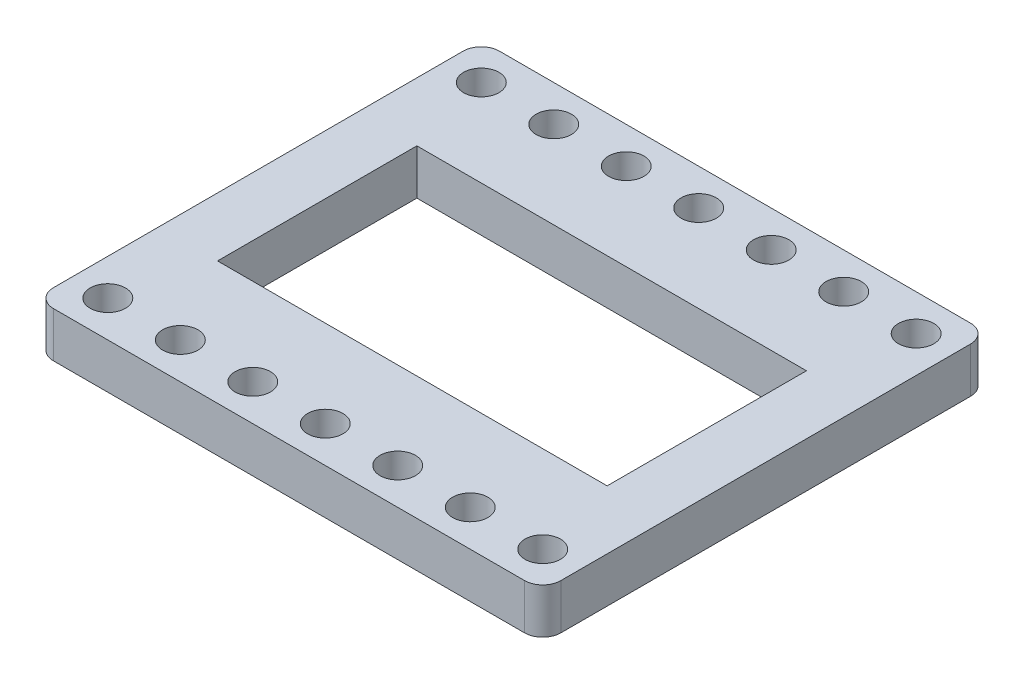
ISO-10303-21;
HEADER;
FILE_DESCRIPTION(('STEP AP214'),'2;1');
FILE_NAME('part.step','',(''),(''),'','','');
FILE_SCHEMA(('AUTOMOTIVE_DESIGN { 1 0 10303 214 1 1 1 1 }'));
ENDSEC;
DATA;
#1=APPLICATION_CONTEXT('core data for automotive mechanical design processes');
#2=APPLICATION_PROTOCOL_DEFINITION('international standard','automotive_design',2000,#1);
#3=PRODUCT_CONTEXT('',#1,'mechanical');
#4=PRODUCT('Part','Part','',(#3));
#5=PRODUCT_RELATED_PRODUCT_CATEGORY('part','',(#4));
#6=PRODUCT_DEFINITION_FORMATION('','',#4);
#7=PRODUCT_DEFINITION_CONTEXT('part definition',#1,'design');
#8=PRODUCT_DEFINITION('design','',#6,#7);
#9=PRODUCT_DEFINITION_SHAPE('','',#8);
#10=(LENGTH_UNIT() NAMED_UNIT(*) SI_UNIT(.MILLI.,.METRE.));
#11=(NAMED_UNIT(*) PLANE_ANGLE_UNIT() SI_UNIT($,.RADIAN.));
#12=(NAMED_UNIT(*) SI_UNIT($,.STERADIAN.) SOLID_ANGLE_UNIT());
#13=UNCERTAINTY_MEASURE_WITH_UNIT(LENGTH_MEASURE(1.E-05),#10,'distance_accuracy_value','');
#14=(GEOMETRIC_REPRESENTATION_CONTEXT(3) GLOBAL_UNCERTAINTY_ASSIGNED_CONTEXT((#13)) GLOBAL_UNIT_ASSIGNED_CONTEXT((#10,
#11,#12)) REPRESENTATION_CONTEXT('',''));
#15=CARTESIAN_POINT('',(0.,0.,0.));
#16=DIRECTION('',(0.,0.,1.));
#17=DIRECTION('',(1.,0.,0.));
#18=AXIS2_PLACEMENT_3D('',#15,#16,#17);
#19=CARTESIAN_POINT('',(-1.99999999999999,5.,47.22));
#20=DIRECTION('',(0.,-1.,0.));
#21=DIRECTION('',(0.,0.,-1.));
#22=AXIS2_PLACEMENT_3D('',#19,#20,#21);
#23=CYLINDRICAL_SURFACE('',#22,2.);
#24=CARTESIAN_POINT('',(-1.99999999999999,0.,47.22));
#25=DIRECTION('',(0.,1.,0.));
#26=DIRECTION('',(0.,0.,1.));
#27=AXIS2_PLACEMENT_3D('',#24,#25,#26);
#28=CIRCLE('',#27,2.);
#29=CARTESIAN_POINT('',(-1.99999999999999,0.,49.22));
#30=VERTEX_POINT('',#29);
#31=CARTESIAN_POINT('',(0.,0.,47.22));
#32=VERTEX_POINT('',#31);
#33=EDGE_CURVE('E241',#30,#32,#28,.T.);
#34=ORIENTED_EDGE('',*,*,#33,.T.);
#35=DIRECTION('',(0.,-1.,0.));
#36=VECTOR('',#35,1.);
#37=CARTESIAN_POINT('',(0.,5.,47.22));
#38=LINE('',#37,#36);
#39=CARTESIAN_POINT('',(0.,5.,47.22));
#40=VERTEX_POINT('',#39);
#41=EDGE_CURVE('E12',#40,#32,#38,.T.);
#42=ORIENTED_EDGE('',*,*,#41,.F.);
#43=CARTESIAN_POINT('',(-1.99999999999999,5.,47.22));
#44=DIRECTION('',(0.,1.,0.));
#45=DIRECTION('',(0.,0.,1.));
#46=AXIS2_PLACEMENT_3D('',#43,#44,#45);
#47=CIRCLE('',#46,2.);
#48=CARTESIAN_POINT('',(-1.99999999999999,5.,49.22));
#49=VERTEX_POINT('',#48);
#50=EDGE_CURVE('E204',#49,#40,#47,.T.);
#51=ORIENTED_EDGE('',*,*,#50,.F.);
#52=DIRECTION('',(0.,-1.,0.));
#53=VECTOR('',#52,1.);
#54=CARTESIAN_POINT('',(-1.99999999999999,5.,49.22));
#55=LINE('',#54,#53);
#56=EDGE_CURVE('E240',#49,#30,#55,.T.);
#57=ORIENTED_EDGE('',*,*,#56,.T.);
#58=EDGE_LOOP('',(#34,#42,#51,#57));
#59=FACE_BOUND('',#58,.T.);
#60=ADVANCED_FACE('F37',(#59),#23,.T.);
#61=CARTESIAN_POINT('',(0.,5.,2.));
#62=DIRECTION('',(-1.,0.,0.));
#63=DIRECTION('',(0.,0.,1.));
#64=AXIS2_PLACEMENT_3D('',#61,#62,#63);
#65=PLANE('',#64);
#66=DIRECTION('',(0.,0.,-1.));
#67=VECTOR('',#66,1.);
#68=CARTESIAN_POINT('',(0.,0.,2.));
#69=LINE('',#68,#67);
#70=CARTESIAN_POINT('',(0.,0.,2.));
#71=VERTEX_POINT('',#70);
#72=EDGE_CURVE('E244',#32,#71,#69,.T.);
#73=ORIENTED_EDGE('',*,*,#72,.T.);
#74=DIRECTION('',(0.,-1.,0.));
#75=VECTOR('',#74,1.);
#76=CARTESIAN_POINT('',(0.,5.,2.));
#77=LINE('',#76,#75);
#78=CARTESIAN_POINT('',(0.,5.,2.));
#79=VERTEX_POINT('',#78);
#80=EDGE_CURVE('E44',#79,#71,#77,.T.);
#81=ORIENTED_EDGE('',*,*,#80,.F.);
#82=DIRECTION('',(0.,0.,-1.));
#83=VECTOR('',#82,1.);
#84=CARTESIAN_POINT('',(0.,5.,2.));
#85=LINE('',#84,#83);
#86=EDGE_CURVE('E209',#40,#79,#85,.T.);
#87=ORIENTED_EDGE('',*,*,#86,.F.);
#88=ORIENTED_EDGE('',*,*,#41,.T.);
#89=EDGE_LOOP('',(#73,#81,#87,#88));
#90=FACE_BOUND('',#89,.T.);
#91=ADVANCED_FACE('F435',(#90),#65,.F.);
#92=CARTESIAN_POINT('',(-2.,5.,2.));
#93=DIRECTION('',(0.,-1.,0.));
#94=DIRECTION('',(0.,0.,-1.));
#95=AXIS2_PLACEMENT_3D('',#92,#93,#94);
#96=CYLINDRICAL_SURFACE('',#95,2.);
#97=CARTESIAN_POINT('',(-2.,0.,2.));
#98=DIRECTION('',(0.,1.,0.));
#99=DIRECTION('',(0.,0.,-1.));
#100=AXIS2_PLACEMENT_3D('',#97,#98,#99);
#101=CIRCLE('',#100,2.);
#102=CARTESIAN_POINT('',(-2.,0.,0.));
#103=VERTEX_POINT('',#102);
#104=EDGE_CURVE('E246',#71,#103,#101,.T.);
#105=ORIENTED_EDGE('',*,*,#104,.T.);
#106=DIRECTION('',(0.,-1.,0.));
#107=VECTOR('',#106,1.);
#108=CARTESIAN_POINT('',(-2.,5.,0.));
#109=LINE('',#108,#107);
#110=CARTESIAN_POINT('',(-2.,5.,0.));
#111=VERTEX_POINT('',#110);
#112=EDGE_CURVE('E271',#111,#103,#109,.T.);
#113=ORIENTED_EDGE('',*,*,#112,.F.);
#114=CARTESIAN_POINT('',(-2.,5.,2.));
#115=DIRECTION('',(0.,1.,0.));
#116=DIRECTION('',(0.,0.,-1.));
#117=AXIS2_PLACEMENT_3D('',#114,#115,#116);
#118=CIRCLE('',#117,2.);
#119=EDGE_CURVE('E214',#79,#111,#118,.T.);
#120=ORIENTED_EDGE('',*,*,#119,.F.);
#121=ORIENTED_EDGE('',*,*,#80,.T.);
#122=EDGE_LOOP('',(#105,#113,#120,#121));
#123=FACE_BOUND('',#122,.T.);
#124=ADVANCED_FACE('F278',(#123),#96,.T.);
#125=CARTESIAN_POINT('',(-54.,5.,0.));
#126=DIRECTION('',(0.,0.,1.));
#127=DIRECTION('',(1.,0.,0.));
#128=AXIS2_PLACEMENT_3D('',#125,#126,#127);
#129=PLANE('',#128);
#130=DIRECTION('',(-1.,0.,0.));
#131=VECTOR('',#130,1.);
#132=CARTESIAN_POINT('',(-54.,0.,0.));
#133=LINE('',#132,#131);
#134=CARTESIAN_POINT('',(-54.,0.,0.));
#135=VERTEX_POINT('',#134);
#136=EDGE_CURVE('E248',#103,#135,#133,.T.);
#137=ORIENTED_EDGE('',*,*,#136,.T.);
#138=DIRECTION('',(0.,-1.,0.));
#139=VECTOR('',#138,1.);
#140=CARTESIAN_POINT('',(-54.,5.,0.));
#141=LINE('',#140,#139);
#142=CARTESIAN_POINT('',(-54.,5.,0.));
#143=VERTEX_POINT('',#142);
#144=EDGE_CURVE('E268',#143,#135,#141,.T.);
#145=ORIENTED_EDGE('',*,*,#144,.F.);
#146=DIRECTION('',(-1.,0.,0.));
#147=VECTOR('',#146,1.);
#148=CARTESIAN_POINT('',(-54.,5.,0.));
#149=LINE('',#148,#147);
#150=EDGE_CURVE('E222',#111,#143,#149,.T.);
#151=ORIENTED_EDGE('',*,*,#150,.F.);
#152=ORIENTED_EDGE('',*,*,#112,.T.);
#153=EDGE_LOOP('',(#137,#145,#151,#152));
#154=FACE_BOUND('',#153,.T.);
#155=ADVANCED_FACE('F288',(#154),#129,.F.);
#156=CARTESIAN_POINT('',(-54.,5.,2.));
#157=DIRECTION('',(0.,-1.,0.));
#158=DIRECTION('',(0.,0.,-1.));
#159=AXIS2_PLACEMENT_3D('',#156,#157,#158);
#160=CYLINDRICAL_SURFACE('',#159,2.);
#161=CARTESIAN_POINT('',(-54.,0.,2.));
#162=DIRECTION('',(0.,1.,0.));
#163=DIRECTION('',(0.,0.,1.));
#164=AXIS2_PLACEMENT_3D('',#161,#162,#163);
#165=CIRCLE('',#164,2.);
#166=CARTESIAN_POINT('',(-56.,0.,2.));
#167=VERTEX_POINT('',#166);
#168=EDGE_CURVE('E250',#135,#167,#165,.T.);
#169=ORIENTED_EDGE('',*,*,#168,.T.);
#170=DIRECTION('',(0.,-1.,0.));
#171=VECTOR('',#170,1.);
#172=CARTESIAN_POINT('',(-56.,5.,2.));
#173=LINE('',#172,#171);
#174=CARTESIAN_POINT('',(-56.,5.,2.));
#175=VERTEX_POINT('',#174);
#176=EDGE_CURVE('E265',#175,#167,#173,.T.);
#177=ORIENTED_EDGE('',*,*,#176,.F.);
#178=CARTESIAN_POINT('',(-54.,5.,2.));
#179=DIRECTION('',(0.,1.,0.));
#180=DIRECTION('',(0.,0.,1.));
#181=AXIS2_PLACEMENT_3D('',#178,#179,#180);
#182=CIRCLE('',#181,2.);
#183=EDGE_CURVE('E225',#143,#175,#182,.T.);
#184=ORIENTED_EDGE('',*,*,#183,.F.);
#185=ORIENTED_EDGE('',*,*,#144,.T.);
#186=EDGE_LOOP('',(#169,#177,#184,#185));
#187=FACE_BOUND('',#186,.T.);
#188=ADVANCED_FACE('F292',(#187),#160,.T.);
#189=CARTESIAN_POINT('',(-56.,5.,2.));
#190=DIRECTION('',(1.,0.,0.));
#191=DIRECTION('',(0.,0.,-1.));
#192=AXIS2_PLACEMENT_3D('',#189,#190,#191);
#193=PLANE('',#192);
#194=DIRECTION('',(0.,0.,1.));
#195=VECTOR('',#194,1.);
#196=CARTESIAN_POINT('',(-56.,0.,2.));
#197=LINE('',#196,#195);
#198=CARTESIAN_POINT('',(-56.,0.,47.22));
#199=VERTEX_POINT('',#198);
#200=EDGE_CURVE('E252',#167,#199,#197,.T.);
#201=ORIENTED_EDGE('',*,*,#200,.T.);
#202=DIRECTION('',(0.,-1.,0.));
#203=VECTOR('',#202,1.);
#204=CARTESIAN_POINT('',(-56.,5.,47.22));
#205=LINE('',#204,#203);
#206=CARTESIAN_POINT('',(-56.,5.,47.22));
#207=VERTEX_POINT('',#206);
#208=EDGE_CURVE('E262',#207,#199,#205,.T.);
#209=ORIENTED_EDGE('',*,*,#208,.F.);
#210=DIRECTION('',(0.,0.,1.));
#211=VECTOR('',#210,1.);
#212=CARTESIAN_POINT('',(-56.,5.,2.));
#213=LINE('',#212,#211);
#214=EDGE_CURVE('E229',#175,#207,#213,.T.);
#215=ORIENTED_EDGE('',*,*,#214,.F.);
#216=ORIENTED_EDGE('',*,*,#176,.T.);
#217=EDGE_LOOP('',(#201,#209,#215,#216));
#218=FACE_BOUND('',#217,.T.);
#219=ADVANCED_FACE('F452',(#218),#193,.F.);
#220=CARTESIAN_POINT('',(-54.,5.,47.22));
#221=DIRECTION('',(0.,-1.,0.));
#222=DIRECTION('',(0.,0.,-1.));
#223=AXIS2_PLACEMENT_3D('',#220,#221,#222);
#224=CYLINDRICAL_SURFACE('',#223,2.);
#225=CARTESIAN_POINT('',(-54.,0.,47.22));
#226=DIRECTION('',(0.,1.,0.));
#227=DIRECTION('',(0.,0.,1.));
#228=AXIS2_PLACEMENT_3D('',#225,#226,#227);
#229=CIRCLE('',#228,2.);
#230=CARTESIAN_POINT('',(-54.,0.,49.22));
#231=VERTEX_POINT('',#230);
#232=EDGE_CURVE('E254',#199,#231,#229,.T.);
#233=ORIENTED_EDGE('',*,*,#232,.T.);
#234=DIRECTION('',(0.,-1.,0.));
#235=VECTOR('',#234,1.);
#236=CARTESIAN_POINT('',(-54.,5.,49.22));
#237=LINE('',#236,#235);
#238=CARTESIAN_POINT('',(-54.,5.,49.22));
#239=VERTEX_POINT('',#238);
#240=EDGE_CURVE('E259',#239,#231,#237,.T.);
#241=ORIENTED_EDGE('',*,*,#240,.F.);
#242=CARTESIAN_POINT('',(-54.,5.,47.22));
#243=DIRECTION('',(0.,1.,0.));
#244=DIRECTION('',(0.,0.,1.));
#245=AXIS2_PLACEMENT_3D('',#242,#243,#244);
#246=CIRCLE('',#245,2.);
#247=EDGE_CURVE('E233',#207,#239,#246,.T.);
#248=ORIENTED_EDGE('',*,*,#247,.F.);
#249=ORIENTED_EDGE('',*,*,#208,.T.);
#250=EDGE_LOOP('',(#233,#241,#248,#249));
#251=FACE_BOUND('',#250,.T.);
#252=ADVANCED_FACE('F450',(#251),#224,.T.);
#253=CARTESIAN_POINT('',(-54.,5.,49.22));
#254=DIRECTION('',(0.,0.,-1.));
#255=DIRECTION('',(-1.,0.,0.));
#256=AXIS2_PLACEMENT_3D('',#253,#254,#255);
#257=PLANE('',#256);
#258=DIRECTION('',(1.,0.,0.));
#259=VECTOR('',#258,1.);
#260=CARTESIAN_POINT('',(-54.,0.,49.22));
#261=LINE('',#260,#259);
#262=EDGE_CURVE('E210',#231,#30,#261,.T.);
#263=ORIENTED_EDGE('',*,*,#262,.T.);
#264=ORIENTED_EDGE('',*,*,#56,.F.);
#265=DIRECTION('',(1.,0.,0.));
#266=VECTOR('',#265,1.);
#267=CARTESIAN_POINT('',(-54.,5.,49.22));
#268=LINE('',#267,#266);
#269=EDGE_CURVE('E236',#239,#49,#268,.T.);
#270=ORIENTED_EDGE('',*,*,#269,.F.);
#271=ORIENTED_EDGE('',*,*,#240,.T.);
#272=EDGE_LOOP('',(#263,#264,#270,#271));
#273=FACE_BOUND('',#272,.T.);
#274=ADVANCED_FACE('F391',(#273),#257,.F.);
#275=CARTESIAN_POINT('',(-1.99999999999999,5.,47.22));
#276=DIRECTION('',(0.,1.,0.));
#277=DIRECTION('',(0.,0.,1.));
#278=AXIS2_PLACEMENT_3D('',#275,#276,#277);
#279=PLANE('',#278);
#280=CARTESIAN_POINT('',(-44.,5.,45.22));
#281=DIRECTION('',(0.,1.,0.));
#282=DIRECTION('',(0.,0.,1.));
#283=AXIS2_PLACEMENT_3D('',#280,#281,#282);
#284=CIRCLE('',#283,1.95);
#285=CARTESIAN_POINT('',(-44.,5.,47.17));
#286=VERTEX_POINT('',#285);
#287=EDGE_CURVE('E180',#286,#286,#284,.T.);
#288=ORIENTED_EDGE('',*,*,#287,.F.);
#289=EDGE_LOOP('',(#288));
#290=FACE_BOUND('',#289,.T.);
#291=CARTESIAN_POINT('',(-52.,5.,45.22));
#292=DIRECTION('',(0.,1.,0.));
#293=DIRECTION('',(0.,0.,1.));
#294=AXIS2_PLACEMENT_3D('',#291,#292,#293);
#295=CIRCLE('',#294,1.95000000000001);
#296=CARTESIAN_POINT('',(-52.,5.,47.17));
#297=VERTEX_POINT('',#296);
#298=EDGE_CURVE('E347',#297,#297,#295,.T.);
#299=ORIENTED_EDGE('',*,*,#298,.F.);
#300=EDGE_LOOP('',(#299));
#301=FACE_BOUND('',#300,.T.);
#302=CARTESIAN_POINT('',(-20.,5.,4.));
#303=DIRECTION('',(0.,1.,0.));
#304=DIRECTION('',(0.,0.,1.));
#305=AXIS2_PLACEMENT_3D('',#302,#303,#304);
#306=CIRCLE('',#305,1.95);
#307=CARTESIAN_POINT('',(-20.,5.,5.95));
#308=VERTEX_POINT('',#307);
#309=EDGE_CURVE('E343',#308,#308,#306,.T.);
#310=ORIENTED_EDGE('',*,*,#309,.F.);
#311=EDGE_LOOP('',(#310));
#312=FACE_BOUND('',#311,.T.);
#313=CARTESIAN_POINT('',(-4.,5.,45.22));
#314=DIRECTION('',(0.,1.,0.));
#315=DIRECTION('',(0.,0.,1.));
#316=AXIS2_PLACEMENT_3D('',#313,#314,#315);
#317=CIRCLE('',#316,1.95);
#318=CARTESIAN_POINT('',(-4.,5.,47.17));
#319=VERTEX_POINT('',#318);
#320=EDGE_CURVE('E338',#319,#319,#317,.T.);
#321=ORIENTED_EDGE('',*,*,#320,.F.);
#322=EDGE_LOOP('',(#321));
#323=FACE_BOUND('',#322,.T.);
#324=CARTESIAN_POINT('',(-12.,5.,45.22));
#325=DIRECTION('',(0.,1.,0.));
#326=DIRECTION('',(0.,0.,1.));
#327=AXIS2_PLACEMENT_3D('',#324,#325,#326);
#328=CIRCLE('',#327,1.95);
#329=CARTESIAN_POINT('',(-12.,5.,47.17));
#330=VERTEX_POINT('',#329);
#331=EDGE_CURVE('E332',#330,#330,#328,.T.);
#332=ORIENTED_EDGE('',*,*,#331,.F.);
#333=EDGE_LOOP('',(#332));
#334=FACE_BOUND('',#333,.T.);
#335=CARTESIAN_POINT('',(-12.,5.,4.));
#336=DIRECTION('',(0.,1.,0.));
#337=DIRECTION('',(0.,0.,1.));
#338=AXIS2_PLACEMENT_3D('',#335,#336,#337);
#339=CIRCLE('',#338,1.95);
#340=CARTESIAN_POINT('',(-12.,5.,5.95));
#341=VERTEX_POINT('',#340);
#342=EDGE_CURVE('E329',#341,#341,#339,.T.);
#343=ORIENTED_EDGE('',*,*,#342,.F.);
#344=EDGE_LOOP('',(#343));
#345=FACE_BOUND('',#344,.T.);
#346=CARTESIAN_POINT('',(-52.,5.,4.00000000000001));
#347=DIRECTION('',(0.,1.,0.));
#348=DIRECTION('',(0.,0.,1.));
#349=AXIS2_PLACEMENT_3D('',#346,#347,#348);
#350=CIRCLE('',#349,1.95000000000001);
#351=CARTESIAN_POINT('',(-52.,5.,5.95000000000001));
#352=VERTEX_POINT('',#351);
#353=EDGE_CURVE('E324',#352,#352,#350,.T.);
#354=ORIENTED_EDGE('',*,*,#353,.F.);
#355=EDGE_LOOP('',(#354));
#356=FACE_BOUND('',#355,.T.);
#357=CARTESIAN_POINT('',(-44.,5.,4.00000000000001));
#358=DIRECTION('',(0.,1.,0.));
#359=DIRECTION('',(0.,0.,1.));
#360=AXIS2_PLACEMENT_3D('',#357,#358,#359);
#361=CIRCLE('',#360,1.95);
#362=CARTESIAN_POINT('',(-44.,5.,5.95));
#363=VERTEX_POINT('',#362);
#364=EDGE_CURVE('E319',#363,#363,#361,.T.);
#365=ORIENTED_EDGE('',*,*,#364,.F.);
#366=EDGE_LOOP('',(#365));
#367=FACE_BOUND('',#366,.T.);
#368=CARTESIAN_POINT('',(-36.,5.,4.));
#369=DIRECTION('',(0.,1.,0.));
#370=DIRECTION('',(0.,0.,1.));
#371=AXIS2_PLACEMENT_3D('',#368,#369,#370);
#372=CIRCLE('',#371,1.95);
#373=CARTESIAN_POINT('',(-36.,5.,5.95));
#374=VERTEX_POINT('',#373);
#375=EDGE_CURVE('E314',#374,#374,#372,.T.);
#376=ORIENTED_EDGE('',*,*,#375,.F.);
#377=EDGE_LOOP('',(#376));
#378=FACE_BOUND('',#377,.T.);
#379=CARTESIAN_POINT('',(-28.,5.,4.));
#380=DIRECTION('',(0.,1.,0.));
#381=DIRECTION('',(0.,0.,1.));
#382=AXIS2_PLACEMENT_3D('',#379,#380,#381);
#383=CIRCLE('',#382,1.95);
#384=CARTESIAN_POINT('',(-28.,5.,5.95));
#385=VERTEX_POINT('',#384);
#386=EDGE_CURVE('E309',#385,#385,#383,.T.);
#387=ORIENTED_EDGE('',*,*,#386,.F.);
#388=EDGE_LOOP('',(#387));
#389=FACE_BOUND('',#388,.T.);
#390=DIRECTION('',(0.,0.,1.));
#391=VECTOR('',#390,1.);
#392=CARTESIAN_POINT('',(-49.5,5.,13.61));
#393=LINE('',#392,#391);
#394=CARTESIAN_POINT('',(-49.5,5.,13.61));
#395=VERTEX_POINT('',#394);
#396=CARTESIAN_POINT('',(-49.5,5.,35.61));
#397=VERTEX_POINT('',#396);
#398=EDGE_CURVE('E51',#395,#397,#393,.T.);
#399=ORIENTED_EDGE('',*,*,#398,.F.);
#400=DIRECTION('',(-1.,0.,0.));
#401=VECTOR('',#400,1.);
#402=CARTESIAN_POINT('',(-49.5,5.,13.61));
#403=LINE('',#402,#401);
#404=CARTESIAN_POINT('',(-6.49999999999999,5.,13.61));
#405=VERTEX_POINT('',#404);
#406=EDGE_CURVE('E143',#405,#395,#403,.T.);
#407=ORIENTED_EDGE('',*,*,#406,.F.);
#408=DIRECTION('',(0.,0.,-1.));
#409=VECTOR('',#408,1.);
#410=CARTESIAN_POINT('',(-6.49999999999999,5.,13.61));
#411=LINE('',#410,#409);
#412=CARTESIAN_POINT('',(-6.49999999999999,5.,35.61));
#413=VERTEX_POINT('',#412);
#414=EDGE_CURVE('E147',#413,#405,#411,.T.);
#415=ORIENTED_EDGE('',*,*,#414,.F.);
#416=DIRECTION('',(1.,0.,0.));
#417=VECTOR('',#416,1.);
#418=CARTESIAN_POINT('',(-49.5,5.,35.61));
#419=LINE('',#418,#417);
#420=EDGE_CURVE('E159',#397,#413,#419,.T.);
#421=ORIENTED_EDGE('',*,*,#420,.F.);
#422=EDGE_LOOP('',(#399,#407,#415,#421));
#423=FACE_BOUND('',#422,.T.);
#424=CARTESIAN_POINT('',(-20.,5.,45.22));
#425=DIRECTION('',(0.,1.,0.));
#426=DIRECTION('',(0.,0.,1.));
#427=AXIS2_PLACEMENT_3D('',#424,#425,#426);
#428=CIRCLE('',#427,1.95);
#429=CARTESIAN_POINT('',(-20.,5.,47.17));
#430=VERTEX_POINT('',#429);
#431=EDGE_CURVE('E150',#430,#430,#428,.T.);
#432=ORIENTED_EDGE('',*,*,#431,.F.);
#433=EDGE_LOOP('',(#432));
#434=FACE_BOUND('',#433,.T.);
#435=CARTESIAN_POINT('',(-28.,5.,45.22));
#436=DIRECTION('',(0.,1.,0.));
#437=DIRECTION('',(0.,0.,1.));
#438=AXIS2_PLACEMENT_3D('',#435,#436,#437);
#439=CIRCLE('',#438,1.95);
#440=CARTESIAN_POINT('',(-28.,5.,47.17));
#441=VERTEX_POINT('',#440);
#442=EDGE_CURVE('E300',#441,#441,#439,.T.);
#443=ORIENTED_EDGE('',*,*,#442,.F.);
#444=EDGE_LOOP('',(#443));
#445=FACE_BOUND('',#444,.T.);
#446=CARTESIAN_POINT('',(-36.,5.,45.22));
#447=DIRECTION('',(0.,1.,0.));
#448=DIRECTION('',(0.,0.,1.));
#449=AXIS2_PLACEMENT_3D('',#446,#447,#448);
#450=CIRCLE('',#449,1.95);
#451=CARTESIAN_POINT('',(-36.,5.,47.17));
#452=VERTEX_POINT('',#451);
#453=EDGE_CURVE('E181',#452,#452,#450,.T.);
#454=ORIENTED_EDGE('',*,*,#453,.F.);
#455=EDGE_LOOP('',(#454));
#456=FACE_BOUND('',#455,.T.);
#457=CARTESIAN_POINT('',(-4.,5.,4.));
#458=DIRECTION('',(0.,1.,0.));
#459=DIRECTION('',(0.,0.,1.));
#460=AXIS2_PLACEMENT_3D('',#457,#458,#459);
#461=CIRCLE('',#460,1.95);
#462=CARTESIAN_POINT('',(-4.,5.,5.94999999999999));
#463=VERTEX_POINT('',#462);
#464=EDGE_CURVE('E196',#463,#463,#461,.T.);
#465=ORIENTED_EDGE('',*,*,#464,.F.);
#466=EDGE_LOOP('',(#465));
#467=FACE_BOUND('',#466,.T.);
#468=ORIENTED_EDGE('',*,*,#50,.T.);
#469=ORIENTED_EDGE('',*,*,#86,.T.);
#470=ORIENTED_EDGE('',*,*,#119,.T.);
#471=ORIENTED_EDGE('',*,*,#150,.T.);
#472=ORIENTED_EDGE('',*,*,#183,.T.);
#473=ORIENTED_EDGE('',*,*,#214,.T.);
#474=ORIENTED_EDGE('',*,*,#247,.T.);
#475=ORIENTED_EDGE('',*,*,#269,.T.);
#476=EDGE_LOOP('',(#468,#469,#470,#471,#472,#473,#474,#475));
#477=FACE_BOUND('',#476,.T.);
#478=ADVANCED_FACE('F296',(#290,#301,#312,#323,#334,#345,#356,#367,#378,#389,#423,#434,#445,
#456,#467,#477),#279,.T.);
#479=CARTESIAN_POINT('',(-1.99999999999999,0.,47.22));
#480=DIRECTION('',(0.,1.,0.));
#481=DIRECTION('',(0.,0.,1.));
#482=AXIS2_PLACEMENT_3D('',#479,#480,#481);
#483=PLANE('',#482);
#484=CARTESIAN_POINT('',(-44.,0.,45.22));
#485=DIRECTION('',(0.,1.,0.));
#486=DIRECTION('',(0.,0.,1.));
#487=AXIS2_PLACEMENT_3D('',#484,#485,#486);
#488=CIRCLE('',#487,1.95);
#489=CARTESIAN_POINT('',(-44.,0.,47.17));
#490=VERTEX_POINT('',#489);
#491=EDGE_CURVE('E350',#490,#490,#488,.T.);
#492=ORIENTED_EDGE('',*,*,#491,.T.);
#493=EDGE_LOOP('',(#492));
#494=FACE_BOUND('',#493,.T.);
#495=CARTESIAN_POINT('',(-52.,0.,45.22));
#496=DIRECTION('',(0.,1.,0.));
#497=DIRECTION('',(0.,0.,1.));
#498=AXIS2_PLACEMENT_3D('',#495,#496,#497);
#499=CIRCLE('',#498,1.95000000000001);
#500=CARTESIAN_POINT('',(-52.,0.,47.17));
#501=VERTEX_POINT('',#500);
#502=EDGE_CURVE('E336',#501,#501,#499,.T.);
#503=ORIENTED_EDGE('',*,*,#502,.T.);
#504=EDGE_LOOP('',(#503));
#505=FACE_BOUND('',#504,.T.);
#506=CARTESIAN_POINT('',(-20.,0.,4.));
#507=DIRECTION('',(0.,1.,0.));
#508=DIRECTION('',(0.,0.,1.));
#509=AXIS2_PLACEMENT_3D('',#506,#507,#508);
#510=CIRCLE('',#509,1.95);
#511=CARTESIAN_POINT('',(-20.,0.,5.95));
#512=VERTEX_POINT('',#511);
#513=EDGE_CURVE('E313',#512,#512,#510,.T.);
#514=ORIENTED_EDGE('',*,*,#513,.T.);
#515=EDGE_LOOP('',(#514));
#516=FACE_BOUND('',#515,.T.);
#517=CARTESIAN_POINT('',(-4.,0.,45.22));
#518=DIRECTION('',(0.,1.,0.));
#519=DIRECTION('',(0.,0.,1.));
#520=AXIS2_PLACEMENT_3D('',#517,#518,#519);
#521=CIRCLE('',#520,1.95);
#522=CARTESIAN_POINT('',(-4.,0.,47.17));
#523=VERTEX_POINT('',#522);
#524=EDGE_CURVE('E341',#523,#523,#521,.T.);
#525=ORIENTED_EDGE('',*,*,#524,.T.);
#526=EDGE_LOOP('',(#525));
#527=FACE_BOUND('',#526,.T.);
#528=CARTESIAN_POINT('',(-12.,0.,45.22));
#529=DIRECTION('',(0.,1.,0.));
#530=DIRECTION('',(0.,0.,1.));
#531=AXIS2_PLACEMENT_3D('',#528,#529,#530);
#532=CIRCLE('',#531,1.95);
#533=CARTESIAN_POINT('',(-12.,0.,47.17));
#534=VERTEX_POINT('',#533);
#535=EDGE_CURVE('E335',#534,#534,#532,.T.);
#536=ORIENTED_EDGE('',*,*,#535,.T.);
#537=EDGE_LOOP('',(#536));
#538=FACE_BOUND('',#537,.T.);
#539=CARTESIAN_POINT('',(-12.,0.,4.));
#540=DIRECTION('',(0.,1.,0.));
#541=DIRECTION('',(0.,0.,1.));
#542=AXIS2_PLACEMENT_3D('',#539,#540,#541);
#543=CIRCLE('',#542,1.95);
#544=CARTESIAN_POINT('',(-12.,0.,5.95));
#545=VERTEX_POINT('',#544);
#546=EDGE_CURVE('E202',#545,#545,#543,.T.);
#547=ORIENTED_EDGE('',*,*,#546,.T.);
#548=EDGE_LOOP('',(#547));
#549=FACE_BOUND('',#548,.T.);
#550=CARTESIAN_POINT('',(-52.,0.,4.00000000000001));
#551=DIRECTION('',(0.,1.,0.));
#552=DIRECTION('',(0.,0.,1.));
#553=AXIS2_PLACEMENT_3D('',#550,#551,#552);
#554=CIRCLE('',#553,1.95000000000001);
#555=CARTESIAN_POINT('',(-52.,0.,5.95000000000001));
#556=VERTEX_POINT('',#555);
#557=EDGE_CURVE('E327',#556,#556,#554,.T.);
#558=ORIENTED_EDGE('',*,*,#557,.T.);
#559=EDGE_LOOP('',(#558));
#560=FACE_BOUND('',#559,.T.);
#561=CARTESIAN_POINT('',(-44.,0.,4.00000000000001));
#562=DIRECTION('',(0.,1.,0.));
#563=DIRECTION('',(0.,0.,1.));
#564=AXIS2_PLACEMENT_3D('',#561,#562,#563);
#565=CIRCLE('',#564,1.95);
#566=CARTESIAN_POINT('',(-44.,0.,5.95));
#567=VERTEX_POINT('',#566);
#568=EDGE_CURVE('E322',#567,#567,#565,.T.);
#569=ORIENTED_EDGE('',*,*,#568,.T.);
#570=EDGE_LOOP('',(#569));
#571=FACE_BOUND('',#570,.T.);
#572=CARTESIAN_POINT('',(-36.,0.,4.));
#573=DIRECTION('',(0.,1.,0.));
#574=DIRECTION('',(0.,0.,1.));
#575=AXIS2_PLACEMENT_3D('',#572,#573,#574);
#576=CIRCLE('',#575,1.95);
#577=CARTESIAN_POINT('',(-36.,0.,5.95));
#578=VERTEX_POINT('',#577);
#579=EDGE_CURVE('E317',#578,#578,#576,.T.);
#580=ORIENTED_EDGE('',*,*,#579,.T.);
#581=EDGE_LOOP('',(#580));
#582=FACE_BOUND('',#581,.T.);
#583=CARTESIAN_POINT('',(-28.,0.,4.));
#584=DIRECTION('',(0.,1.,0.));
#585=DIRECTION('',(0.,0.,1.));
#586=AXIS2_PLACEMENT_3D('',#583,#584,#585);
#587=CIRCLE('',#586,1.95);
#588=CARTESIAN_POINT('',(-28.,0.,5.95));
#589=VERTEX_POINT('',#588);
#590=EDGE_CURVE('E312',#589,#589,#587,.T.);
#591=ORIENTED_EDGE('',*,*,#590,.T.);
#592=EDGE_LOOP('',(#591));
#593=FACE_BOUND('',#592,.T.);
#594=DIRECTION('',(-1.,0.,0.));
#595=VECTOR('',#594,1.);
#596=CARTESIAN_POINT('',(-49.5,0.,13.61));
#597=LINE('',#596,#595);
#598=CARTESIAN_POINT('',(-6.49999999999999,0.,13.61));
#599=VERTEX_POINT('',#598);
#600=CARTESIAN_POINT('',(-49.5,0.,13.61));
#601=VERTEX_POINT('',#600);
#602=EDGE_CURVE('E133',#599,#601,#597,.T.);
#603=ORIENTED_EDGE('',*,*,#602,.T.);
#604=DIRECTION('',(0.,0.,1.));
#605=VECTOR('',#604,1.);
#606=CARTESIAN_POINT('',(-49.5,0.,13.61));
#607=LINE('',#606,#605);
#608=CARTESIAN_POINT('',(-49.5,0.,35.61));
#609=VERTEX_POINT('',#608);
#610=EDGE_CURVE('E127',#601,#609,#607,.T.);
#611=ORIENTED_EDGE('',*,*,#610,.T.);
#612=DIRECTION('',(1.,0.,0.));
#613=VECTOR('',#612,1.);
#614=CARTESIAN_POINT('',(-49.5,0.,35.61));
#615=LINE('',#614,#613);
#616=CARTESIAN_POINT('',(-6.49999999999999,0.,35.61));
#617=VERTEX_POINT('',#616);
#618=EDGE_CURVE('E136',#609,#617,#615,.T.);
#619=ORIENTED_EDGE('',*,*,#618,.T.);
#620=DIRECTION('',(0.,0.,-1.));
#621=VECTOR('',#620,1.);
#622=CARTESIAN_POINT('',(-6.49999999999999,0.,13.61));
#623=LINE('',#622,#621);
#624=EDGE_CURVE('E59',#617,#599,#623,.T.);
#625=ORIENTED_EDGE('',*,*,#624,.T.);
#626=EDGE_LOOP('',(#603,#611,#619,#625));
#627=FACE_BOUND('',#626,.T.);
#628=CARTESIAN_POINT('',(-20.,0.,45.22));
#629=DIRECTION('',(0.,1.,0.));
#630=DIRECTION('',(0.,0.,1.));
#631=AXIS2_PLACEMENT_3D('',#628,#629,#630);
#632=CIRCLE('',#631,1.95);
#633=CARTESIAN_POINT('',(-20.,0.,47.17));
#634=VERTEX_POINT('',#633);
#635=EDGE_CURVE('E303',#634,#634,#632,.T.);
#636=ORIENTED_EDGE('',*,*,#635,.T.);
#637=EDGE_LOOP('',(#636));
#638=FACE_BOUND('',#637,.T.);
#639=CARTESIAN_POINT('',(-28.,0.,45.22));
#640=DIRECTION('',(0.,1.,0.));
#641=DIRECTION('',(0.,0.,1.));
#642=AXIS2_PLACEMENT_3D('',#639,#640,#641);
#643=CIRCLE('',#642,1.95);
#644=CARTESIAN_POINT('',(-28.,0.,47.17));
#645=VERTEX_POINT('',#644);
#646=EDGE_CURVE('E186',#645,#645,#643,.T.);
#647=ORIENTED_EDGE('',*,*,#646,.T.);
#648=EDGE_LOOP('',(#647));
#649=FACE_BOUND('',#648,.T.);
#650=CARTESIAN_POINT('',(-36.,0.,45.22));
#651=DIRECTION('',(0.,1.,0.));
#652=DIRECTION('',(0.,0.,1.));
#653=AXIS2_PLACEMENT_3D('',#650,#651,#652);
#654=CIRCLE('',#653,1.95);
#655=CARTESIAN_POINT('',(-36.,0.,47.17));
#656=VERTEX_POINT('',#655);
#657=EDGE_CURVE('E177',#656,#656,#654,.T.);
#658=ORIENTED_EDGE('',*,*,#657,.T.);
#659=EDGE_LOOP('',(#658));
#660=FACE_BOUND('',#659,.T.);
#661=CARTESIAN_POINT('',(-4.,0.,4.));
#662=DIRECTION('',(0.,1.,0.));
#663=DIRECTION('',(0.,0.,1.));
#664=AXIS2_PLACEMENT_3D('',#661,#662,#663);
#665=CIRCLE('',#664,1.95);
#666=CARTESIAN_POINT('',(-4.,0.,5.94999999999999));
#667=VERTEX_POINT('',#666);
#668=EDGE_CURVE('E201',#667,#667,#665,.T.);
#669=ORIENTED_EDGE('',*,*,#668,.T.);
#670=EDGE_LOOP('',(#669));
#671=FACE_BOUND('',#670,.T.);
#672=ORIENTED_EDGE('',*,*,#33,.F.);
#673=ORIENTED_EDGE('',*,*,#262,.F.);
#674=ORIENTED_EDGE('',*,*,#232,.F.);
#675=ORIENTED_EDGE('',*,*,#200,.F.);
#676=ORIENTED_EDGE('',*,*,#168,.F.);
#677=ORIENTED_EDGE('',*,*,#136,.F.);
#678=ORIENTED_EDGE('',*,*,#104,.F.);
#679=ORIENTED_EDGE('',*,*,#72,.F.);
#680=EDGE_LOOP('',(#672,#673,#674,#675,#676,#677,#678,#679));
#681=FACE_BOUND('',#680,.T.);
#682=ADVANCED_FACE('F140',(#494,#505,#516,#527,#538,#549,#560,#571,#582,#593,#627,#638,#649,
#660,#671,#681),#483,.F.);
#683=CARTESIAN_POINT('',(-4.,0.,4.));
#684=DIRECTION('',(0.,1.,0.));
#685=DIRECTION('',(0.,0.,1.));
#686=AXIS2_PLACEMENT_3D('',#683,#684,#685);
#687=CYLINDRICAL_SURFACE('',#686,1.95);
#688=ORIENTED_EDGE('',*,*,#668,.F.);
#689=EDGE_LOOP('',(#688));
#690=FACE_BOUND('',#689,.T.);
#691=ORIENTED_EDGE('',*,*,#464,.T.);
#692=EDGE_LOOP('',(#691));
#693=FACE_BOUND('',#692,.T.);
#694=ADVANCED_FACE('F418',(#690,#693),#687,.F.);
#695=CARTESIAN_POINT('',(-36.,0.,45.22));
#696=DIRECTION('',(0.,1.,0.));
#697=DIRECTION('',(0.,0.,1.));
#698=AXIS2_PLACEMENT_3D('',#695,#696,#697);
#699=CYLINDRICAL_SURFACE('',#698,1.95);
#700=ORIENTED_EDGE('',*,*,#657,.F.);
#701=EDGE_LOOP('',(#700));
#702=FACE_BOUND('',#701,.T.);
#703=ORIENTED_EDGE('',*,*,#453,.T.);
#704=EDGE_LOOP('',(#703));
#705=FACE_BOUND('',#704,.T.);
#706=ADVANCED_FACE('F420',(#702,#705),#699,.F.);
#707=CARTESIAN_POINT('',(-28.,0.,45.22));
#708=DIRECTION('',(0.,1.,0.));
#709=DIRECTION('',(0.,0.,1.));
#710=AXIS2_PLACEMENT_3D('',#707,#708,#709);
#711=CYLINDRICAL_SURFACE('',#710,1.95);
#712=ORIENTED_EDGE('',*,*,#646,.F.);
#713=EDGE_LOOP('',(#712));
#714=FACE_BOUND('',#713,.T.);
#715=ORIENTED_EDGE('',*,*,#442,.T.);
#716=EDGE_LOOP('',(#715));
#717=FACE_BOUND('',#716,.T.);
#718=ADVANCED_FACE('F427',(#714,#717),#711,.F.);
#719=CARTESIAN_POINT('',(-20.,0.,45.22));
#720=DIRECTION('',(0.,1.,0.));
#721=DIRECTION('',(0.,0.,1.));
#722=AXIS2_PLACEMENT_3D('',#719,#720,#721);
#723=CYLINDRICAL_SURFACE('',#722,1.95);
#724=ORIENTED_EDGE('',*,*,#635,.F.);
#725=EDGE_LOOP('',(#724));
#726=FACE_BOUND('',#725,.T.);
#727=ORIENTED_EDGE('',*,*,#431,.T.);
#728=EDGE_LOOP('',(#727));
#729=FACE_BOUND('',#728,.T.);
#730=ADVANCED_FACE('F526',(#726,#729),#723,.F.);
#731=CARTESIAN_POINT('',(-49.5,0.,13.61));
#732=DIRECTION('',(-1.,0.,0.));
#733=DIRECTION('',(0.,0.,1.));
#734=AXIS2_PLACEMENT_3D('',#731,#732,#733);
#735=PLANE('',#734);
#736=ORIENTED_EDGE('',*,*,#398,.T.);
#737=DIRECTION('',(0.,1.,0.));
#738=VECTOR('',#737,1.);
#739=CARTESIAN_POINT('',(-49.5,0.,35.61));
#740=LINE('',#739,#738);
#741=EDGE_CURVE('E123',#609,#397,#740,.T.);
#742=ORIENTED_EDGE('',*,*,#741,.F.);
#743=ORIENTED_EDGE('',*,*,#610,.F.);
#744=DIRECTION('',(0.,1.,0.));
#745=VECTOR('',#744,1.);
#746=CARTESIAN_POINT('',(-49.5,0.,13.61));
#747=LINE('',#746,#745);
#748=EDGE_CURVE('E172',#601,#395,#747,.T.);
#749=ORIENTED_EDGE('',*,*,#748,.T.);
#750=EDGE_LOOP('',(#736,#742,#743,#749));
#751=FACE_BOUND('',#750,.T.);
#752=ADVANCED_FACE('F125',(#751),#735,.F.);
#753=CARTESIAN_POINT('',(-49.5,0.,13.61));
#754=DIRECTION('',(0.,0.,-1.));
#755=DIRECTION('',(-1.,0.,0.));
#756=AXIS2_PLACEMENT_3D('',#753,#754,#755);
#757=PLANE('',#756);
#758=ORIENTED_EDGE('',*,*,#406,.T.);
#759=ORIENTED_EDGE('',*,*,#748,.F.);
#760=ORIENTED_EDGE('',*,*,#602,.F.);
#761=DIRECTION('',(0.,1.,0.));
#762=VECTOR('',#761,1.);
#763=CARTESIAN_POINT('',(-6.49999999999999,0.,13.61));
#764=LINE('',#763,#762);
#765=EDGE_CURVE('E174',#599,#405,#764,.T.);
#766=ORIENTED_EDGE('',*,*,#765,.T.);
#767=EDGE_LOOP('',(#758,#759,#760,#766));
#768=FACE_BOUND('',#767,.T.);
#769=ADVANCED_FACE('F545',(#768),#757,.F.);
#770=CARTESIAN_POINT('',(-6.49999999999999,0.,13.61));
#771=DIRECTION('',(1.,0.,0.));
#772=DIRECTION('',(0.,0.,-1.));
#773=AXIS2_PLACEMENT_3D('',#770,#771,#772);
#774=PLANE('',#773);
#775=ORIENTED_EDGE('',*,*,#414,.T.);
#776=ORIENTED_EDGE('',*,*,#765,.F.);
#777=ORIENTED_EDGE('',*,*,#624,.F.);
#778=DIRECTION('',(0.,1.,0.));
#779=VECTOR('',#778,1.);
#780=CARTESIAN_POINT('',(-6.49999999999999,0.,35.61));
#781=LINE('',#780,#779);
#782=EDGE_CURVE('E132',#617,#413,#781,.T.);
#783=ORIENTED_EDGE('',*,*,#782,.T.);
#784=EDGE_LOOP('',(#775,#776,#777,#783));
#785=FACE_BOUND('',#784,.T.);
#786=ADVANCED_FACE('F554',(#785),#774,.F.);
#787=CARTESIAN_POINT('',(-49.5,0.,35.61));
#788=DIRECTION('',(0.,0.,1.));
#789=DIRECTION('',(1.,0.,0.));
#790=AXIS2_PLACEMENT_3D('',#787,#788,#789);
#791=PLANE('',#790);
#792=ORIENTED_EDGE('',*,*,#420,.T.);
#793=ORIENTED_EDGE('',*,*,#782,.F.);
#794=ORIENTED_EDGE('',*,*,#618,.F.);
#795=ORIENTED_EDGE('',*,*,#741,.T.);
#796=EDGE_LOOP('',(#792,#793,#794,#795));
#797=FACE_BOUND('',#796,.T.);
#798=ADVANCED_FACE('F137',(#797),#791,.F.);
#799=CARTESIAN_POINT('',(-28.,0.,4.));
#800=DIRECTION('',(0.,1.,0.));
#801=DIRECTION('',(0.,0.,1.));
#802=AXIS2_PLACEMENT_3D('',#799,#800,#801);
#803=CYLINDRICAL_SURFACE('',#802,1.95);
#804=ORIENTED_EDGE('',*,*,#590,.F.);
#805=EDGE_LOOP('',(#804));
#806=FACE_BOUND('',#805,.T.);
#807=ORIENTED_EDGE('',*,*,#386,.T.);
#808=EDGE_LOOP('',(#807));
#809=FACE_BOUND('',#808,.T.);
#810=ADVANCED_FACE('F572',(#806,#809),#803,.F.);
#811=CARTESIAN_POINT('',(-36.,0.,4.));
#812=DIRECTION('',(0.,1.,0.));
#813=DIRECTION('',(0.,0.,1.));
#814=AXIS2_PLACEMENT_3D('',#811,#812,#813);
#815=CYLINDRICAL_SURFACE('',#814,1.95);
#816=ORIENTED_EDGE('',*,*,#579,.F.);
#817=EDGE_LOOP('',(#816));
#818=FACE_BOUND('',#817,.T.);
#819=ORIENTED_EDGE('',*,*,#375,.T.);
#820=EDGE_LOOP('',(#819));
#821=FACE_BOUND('',#820,.T.);
#822=ADVANCED_FACE('F581',(#818,#821),#815,.F.);
#823=CARTESIAN_POINT('',(-44.,0.,4.00000000000001));
#824=DIRECTION('',(0.,1.,0.));
#825=DIRECTION('',(0.,0.,1.));
#826=AXIS2_PLACEMENT_3D('',#823,#824,#825);
#827=CYLINDRICAL_SURFACE('',#826,1.95);
#828=ORIENTED_EDGE('',*,*,#568,.F.);
#829=EDGE_LOOP('',(#828));
#830=FACE_BOUND('',#829,.T.);
#831=ORIENTED_EDGE('',*,*,#364,.T.);
#832=EDGE_LOOP('',(#831));
#833=FACE_BOUND('',#832,.T.);
#834=ADVANCED_FACE('F591',(#830,#833),#827,.F.);
#835=CARTESIAN_POINT('',(-52.,0.,4.00000000000001));
#836=DIRECTION('',(0.,1.,0.));
#837=DIRECTION('',(0.,0.,1.));
#838=AXIS2_PLACEMENT_3D('',#835,#836,#837);
#839=CYLINDRICAL_SURFACE('',#838,1.95000000000001);
#840=ORIENTED_EDGE('',*,*,#557,.F.);
#841=EDGE_LOOP('',(#840));
#842=FACE_BOUND('',#841,.T.);
#843=ORIENTED_EDGE('',*,*,#353,.T.);
#844=EDGE_LOOP('',(#843));
#845=FACE_BOUND('',#844,.T.);
#846=ADVANCED_FACE('F601',(#842,#845),#839,.F.);
#847=CARTESIAN_POINT('',(-12.,0.,4.));
#848=DIRECTION('',(0.,1.,0.));
#849=DIRECTION('',(0.,0.,1.));
#850=AXIS2_PLACEMENT_3D('',#847,#848,#849);
#851=CYLINDRICAL_SURFACE('',#850,1.95);
#852=ORIENTED_EDGE('',*,*,#546,.F.);
#853=EDGE_LOOP('',(#852));
#854=FACE_BOUND('',#853,.T.);
#855=ORIENTED_EDGE('',*,*,#342,.T.);
#856=EDGE_LOOP('',(#855));
#857=FACE_BOUND('',#856,.T.);
#858=ADVANCED_FACE('F611',(#854,#857),#851,.F.);
#859=CARTESIAN_POINT('',(-12.,0.,45.22));
#860=DIRECTION('',(0.,1.,0.));
#861=DIRECTION('',(0.,0.,1.));
#862=AXIS2_PLACEMENT_3D('',#859,#860,#861);
#863=CYLINDRICAL_SURFACE('',#862,1.95);
#864=ORIENTED_EDGE('',*,*,#535,.F.);
#865=EDGE_LOOP('',(#864));
#866=FACE_BOUND('',#865,.T.);
#867=ORIENTED_EDGE('',*,*,#331,.T.);
#868=EDGE_LOOP('',(#867));
#869=FACE_BOUND('',#868,.T.);
#870=ADVANCED_FACE('F621',(#866,#869),#863,.F.);
#871=CARTESIAN_POINT('',(-4.,0.,45.22));
#872=DIRECTION('',(0.,1.,0.));
#873=DIRECTION('',(0.,0.,1.));
#874=AXIS2_PLACEMENT_3D('',#871,#872,#873);
#875=CYLINDRICAL_SURFACE('',#874,1.95);
#876=ORIENTED_EDGE('',*,*,#524,.F.);
#877=EDGE_LOOP('',(#876));
#878=FACE_BOUND('',#877,.T.);
#879=ORIENTED_EDGE('',*,*,#320,.T.);
#880=EDGE_LOOP('',(#879));
#881=FACE_BOUND('',#880,.T.);
#882=ADVANCED_FACE('F385',(#878,#881),#875,.F.);
#883=CARTESIAN_POINT('',(-20.,0.,4.));
#884=DIRECTION('',(0.,1.,0.));
#885=DIRECTION('',(0.,0.,1.));
#886=AXIS2_PLACEMENT_3D('',#883,#884,#885);
#887=CYLINDRICAL_SURFACE('',#886,1.95);
#888=ORIENTED_EDGE('',*,*,#513,.F.);
#889=EDGE_LOOP('',(#888));
#890=FACE_BOUND('',#889,.T.);
#891=ORIENTED_EDGE('',*,*,#309,.T.);
#892=EDGE_LOOP('',(#891));
#893=FACE_BOUND('',#892,.T.);
#894=ADVANCED_FACE('F381',(#890,#893),#887,.F.);
#895=CARTESIAN_POINT('',(-52.,0.,45.22));
#896=DIRECTION('',(0.,1.,0.));
#897=DIRECTION('',(0.,0.,1.));
#898=AXIS2_PLACEMENT_3D('',#895,#896,#897);
#899=CYLINDRICAL_SURFACE('',#898,1.95000000000001);
#900=ORIENTED_EDGE('',*,*,#502,.F.);
#901=EDGE_LOOP('',(#900));
#902=FACE_BOUND('',#901,.T.);
#903=ORIENTED_EDGE('',*,*,#298,.T.);
#904=EDGE_LOOP('',(#903));
#905=FACE_BOUND('',#904,.T.);
#906=ADVANCED_FACE('F384',(#902,#905),#899,.F.);
#907=CARTESIAN_POINT('',(-44.,0.,45.22));
#908=DIRECTION('',(0.,1.,0.));
#909=DIRECTION('',(0.,0.,1.));
#910=AXIS2_PLACEMENT_3D('',#907,#908,#909);
#911=CYLINDRICAL_SURFACE('',#910,1.95);
#912=ORIENTED_EDGE('',*,*,#491,.F.);
#913=EDGE_LOOP('',(#912));
#914=FACE_BOUND('',#913,.T.);
#915=ORIENTED_EDGE('',*,*,#287,.T.);
#916=EDGE_LOOP('',(#915));
#917=FACE_BOUND('',#916,.T.);
#918=ADVANCED_FACE('F654',(#914,#917),#911,.F.);
#919=CLOSED_SHELL('',(#60,#91,#124,#155,#188,#219,#252,#274,#478,#682,#694,#706,#718,#730,#752,
#769,#786,#798,#810,#822,#834,#846,#858,#870,#882,#894,#906,#918));
#920=MANIFOLD_SOLID_BREP('B2',#919);
#921=ADVANCED_BREP_SHAPE_REPRESENTATION('',(#18,#920),#14);
#922=SHAPE_DEFINITION_REPRESENTATION(#9,#921);
ENDSEC;
END-ISO-10303-21;
